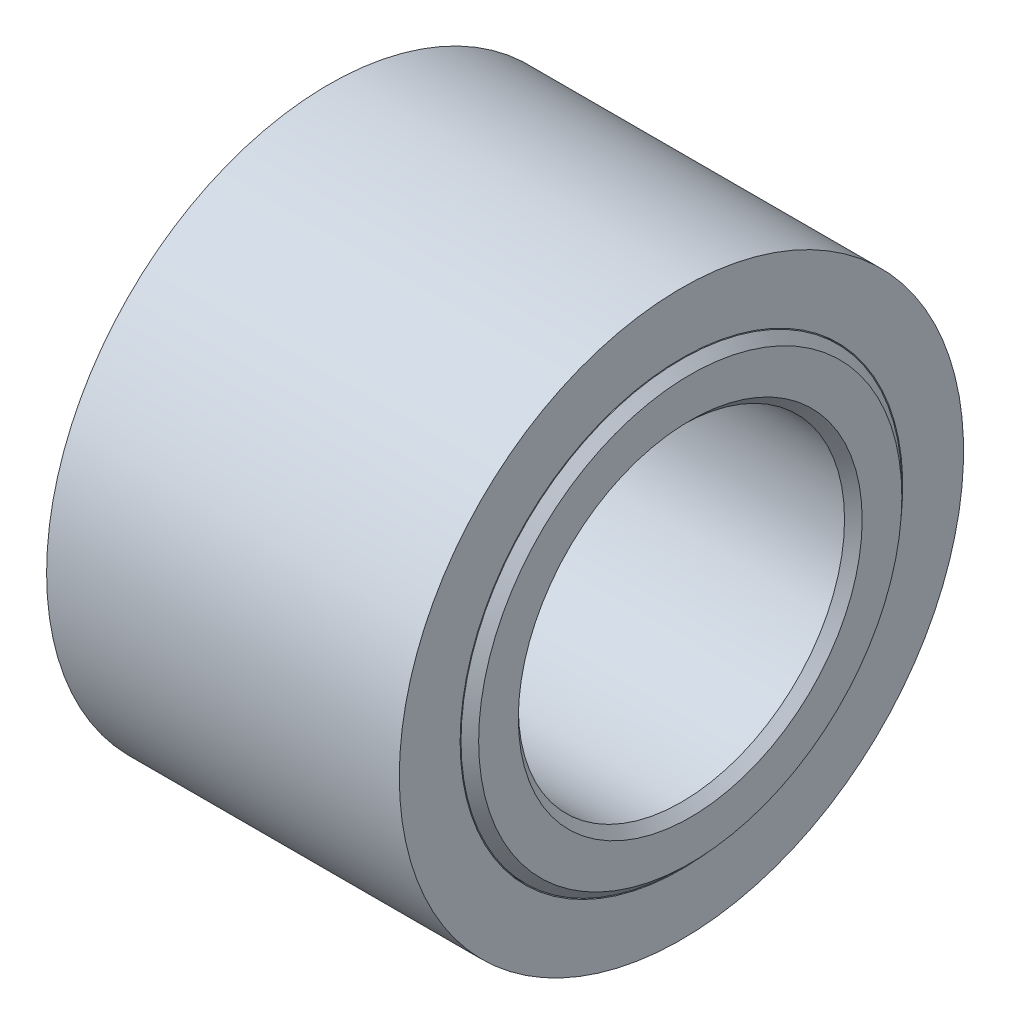
ISO-10303-21;
HEADER;
FILE_DESCRIPTION(('STEP AP214'),'2;1');
FILE_NAME('part.step','',(''),(''),'','','');
FILE_SCHEMA(('AUTOMOTIVE_DESIGN { 1 0 10303 214 1 1 1 1 }'));
ENDSEC;
DATA;
#1=APPLICATION_CONTEXT('core data for automotive mechanical design processes');
#2=APPLICATION_PROTOCOL_DEFINITION('international standard','automotive_design',2000,#1);
#3=PRODUCT_CONTEXT('',#1,'mechanical');
#4=PRODUCT('Part','Part','',(#3));
#5=PRODUCT_RELATED_PRODUCT_CATEGORY('part','',(#4));
#6=PRODUCT_DEFINITION_FORMATION('','',#4);
#7=PRODUCT_DEFINITION_CONTEXT('part definition',#1,'design');
#8=PRODUCT_DEFINITION('design','',#6,#7);
#9=PRODUCT_DEFINITION_SHAPE('','',#8);
#10=(LENGTH_UNIT() NAMED_UNIT(*) SI_UNIT(.MILLI.,.METRE.));
#11=(NAMED_UNIT(*) PLANE_ANGLE_UNIT() SI_UNIT($,.RADIAN.));
#12=(NAMED_UNIT(*) SI_UNIT($,.STERADIAN.) SOLID_ANGLE_UNIT());
#13=UNCERTAINTY_MEASURE_WITH_UNIT(LENGTH_MEASURE(1.E-05),#10,'distance_accuracy_value','');
#14=(GEOMETRIC_REPRESENTATION_CONTEXT(3) GLOBAL_UNCERTAINTY_ASSIGNED_CONTEXT((#13)) GLOBAL_UNIT_ASSIGNED_CONTEXT((#10,
#11,#12)) REPRESENTATION_CONTEXT('',''));
#15=CARTESIAN_POINT('',(0.,0.,0.));
#16=DIRECTION('',(0.,0.,1.));
#17=DIRECTION('',(1.,0.,0.));
#18=AXIS2_PLACEMENT_3D('',#15,#16,#17);
#19=CARTESIAN_POINT('',(0.,0.,0.));
#20=DIRECTION('',(-1.,0.,0.));
#21=DIRECTION('',(0.,0.,1.));
#22=AXIS2_PLACEMENT_3D('',#19,#20,#21);
#23=CYLINDRICAL_SURFACE('',#22,11.1);
#24=CARTESIAN_POINT('',(19.45,0.,0.));
#25=DIRECTION('',(-1.,0.,0.));
#26=DIRECTION('',(0.,0.,1.));
#27=AXIS2_PLACEMENT_3D('',#24,#25,#26);
#28=CIRCLE('',#27,11.1);
#29=CARTESIAN_POINT('',(19.45,0.,11.1));
#30=VERTEX_POINT('',#29);
#31=EDGE_CURVE('E72',#30,#30,#28,.T.);
#32=ORIENTED_EDGE('',*,*,#31,.F.);
#33=EDGE_LOOP('',(#32));
#34=FACE_BOUND('',#33,.T.);
#35=CARTESIAN_POINT('',(1.55,0.,0.));
#36=DIRECTION('',(-1.,0.,0.));
#37=DIRECTION('',(0.,0.,1.));
#38=AXIS2_PLACEMENT_3D('',#35,#36,#37);
#39=CIRCLE('',#38,11.1);
#40=CARTESIAN_POINT('',(1.55,0.,11.1));
#41=VERTEX_POINT('',#40);
#42=EDGE_CURVE('E11',#41,#41,#39,.T.);
#43=ORIENTED_EDGE('',*,*,#42,.T.);
#44=EDGE_LOOP('',(#43));
#45=FACE_BOUND('',#44,.T.);
#46=ADVANCED_FACE('F44',(#34,#45),#23,.F.);
#47=CARTESIAN_POINT('',(1.55,11.1,0.));
#48=DIRECTION('',(1.,0.,0.));
#49=DIRECTION('',(0.,0.,-1.));
#50=AXIS2_PLACEMENT_3D('',#47,#48,#49);
#51=PLANE('',#50);
#52=ORIENTED_EDGE('',*,*,#42,.F.);
#53=EDGE_LOOP('',(#52));
#54=FACE_BOUND('',#53,.T.);
#55=CARTESIAN_POINT('',(1.55,0.,0.));
#56=DIRECTION('',(-1.,0.,0.));
#57=DIRECTION('',(0.,0.,1.));
#58=AXIS2_PLACEMENT_3D('',#55,#56,#57);
#59=CIRCLE('',#58,12.55);
#60=CARTESIAN_POINT('',(1.55,0.,12.55));
#61=VERTEX_POINT('',#60);
#62=EDGE_CURVE('E50',#61,#61,#59,.T.);
#63=ORIENTED_EDGE('',*,*,#62,.T.);
#64=EDGE_LOOP('',(#63));
#65=FACE_BOUND('',#64,.T.);
#66=ADVANCED_FACE('F79',(#54,#65),#51,.F.);
#67=CARTESIAN_POINT('',(0.,0.,0.));
#68=DIRECTION('',(-1.,0.,0.));
#69=DIRECTION('',(0.,0.,1.));
#70=AXIS2_PLACEMENT_3D('',#67,#68,#69);
#71=CYLINDRICAL_SURFACE('',#70,12.55);
#72=ORIENTED_EDGE('',*,*,#62,.F.);
#73=EDGE_LOOP('',(#72));
#74=FACE_BOUND('',#73,.T.);
#75=CARTESIAN_POINT('',(0.5,0.,0.));
#76=DIRECTION('',(-1.,0.,0.));
#77=DIRECTION('',(0.,0.,1.));
#78=AXIS2_PLACEMENT_3D('',#75,#76,#77);
#79=CIRCLE('',#78,12.55);
#80=CARTESIAN_POINT('',(0.5,0.,12.55));
#81=VERTEX_POINT('',#80);
#82=EDGE_CURVE('E54',#81,#81,#79,.T.);
#83=ORIENTED_EDGE('',*,*,#82,.T.);
#84=EDGE_LOOP('',(#83));
#85=FACE_BOUND('',#84,.T.);
#86=ADVANCED_FACE('F83',(#74,#85),#71,.F.);
#87=CARTESIAN_POINT('',(0.5,12.55,0.));
#88=DIRECTION('',(1.,0.,0.));
#89=DIRECTION('',(0.,0.,-1.));
#90=AXIS2_PLACEMENT_3D('',#87,#88,#89);
#91=PLANE('',#90);
#92=ORIENTED_EDGE('',*,*,#82,.F.);
#93=EDGE_LOOP('',(#92));
#94=FACE_BOUND('',#93,.T.);
#95=CARTESIAN_POINT('',(0.5,0.,0.));
#96=DIRECTION('',(-1.,0.,0.));
#97=DIRECTION('',(0.,0.,1.));
#98=AXIS2_PLACEMENT_3D('',#95,#96,#97);
#99=CIRCLE('',#98,16.);
#100=CARTESIAN_POINT('',(0.5,0.,16.));
#101=VERTEX_POINT('',#100);
#102=EDGE_CURVE('E58',#101,#101,#99,.T.);
#103=ORIENTED_EDGE('',*,*,#102,.T.);
#104=EDGE_LOOP('',(#103));
#105=FACE_BOUND('',#104,.T.);
#106=ADVANCED_FACE('F88',(#94,#105),#91,.F.);
#107=CARTESIAN_POINT('',(0.,0.,0.));
#108=DIRECTION('',(-1.,0.,0.));
#109=DIRECTION('',(0.,0.,1.));
#110=AXIS2_PLACEMENT_3D('',#107,#108,#109);
#111=CYLINDRICAL_SURFACE('',#110,16.);
#112=ORIENTED_EDGE('',*,*,#102,.F.);
#113=EDGE_LOOP('',(#112));
#114=FACE_BOUND('',#113,.T.);
#115=CARTESIAN_POINT('',(20.5,0.,0.));
#116=DIRECTION('',(-1.,0.,0.));
#117=DIRECTION('',(0.,0.,1.));
#118=AXIS2_PLACEMENT_3D('',#115,#116,#117);
#119=CIRCLE('',#118,16.);
#120=CARTESIAN_POINT('',(20.5,0.,16.));
#121=VERTEX_POINT('',#120);
#122=EDGE_CURVE('E63',#121,#121,#119,.T.);
#123=ORIENTED_EDGE('',*,*,#122,.T.);
#124=EDGE_LOOP('',(#123));
#125=FACE_BOUND('',#124,.T.);
#126=ADVANCED_FACE('F94',(#114,#125),#111,.T.);
#127=CARTESIAN_POINT('',(20.5,16.,0.));
#128=DIRECTION('',(-1.,0.,0.));
#129=DIRECTION('',(0.,0.,1.));
#130=AXIS2_PLACEMENT_3D('',#127,#128,#129);
#131=PLANE('',#130);
#132=ORIENTED_EDGE('',*,*,#122,.F.);
#133=EDGE_LOOP('',(#132));
#134=FACE_BOUND('',#133,.T.);
#135=CARTESIAN_POINT('',(20.5,0.,0.));
#136=DIRECTION('',(-1.,0.,0.));
#137=DIRECTION('',(0.,0.,1.));
#138=AXIS2_PLACEMENT_3D('',#135,#136,#137);
#139=CIRCLE('',#138,12.55);
#140=CARTESIAN_POINT('',(20.5,0.,12.55));
#141=VERTEX_POINT('',#140);
#142=EDGE_CURVE('E66',#141,#141,#139,.T.);
#143=ORIENTED_EDGE('',*,*,#142,.T.);
#144=EDGE_LOOP('',(#143));
#145=FACE_BOUND('',#144,.T.);
#146=ADVANCED_FACE('F98',(#134,#145),#131,.F.);
#147=CARTESIAN_POINT('',(0.,0.,0.));
#148=DIRECTION('',(-1.,0.,0.));
#149=DIRECTION('',(0.,0.,1.));
#150=AXIS2_PLACEMENT_3D('',#147,#148,#149);
#151=CYLINDRICAL_SURFACE('',#150,12.55);
#152=ORIENTED_EDGE('',*,*,#142,.F.);
#153=EDGE_LOOP('',(#152));
#154=FACE_BOUND('',#153,.T.);
#155=CARTESIAN_POINT('',(19.45,0.,0.));
#156=DIRECTION('',(-1.,0.,0.));
#157=DIRECTION('',(0.,0.,1.));
#158=AXIS2_PLACEMENT_3D('',#155,#156,#157);
#159=CIRCLE('',#158,12.55);
#160=CARTESIAN_POINT('',(19.45,0.,12.55));
#161=VERTEX_POINT('',#160);
#162=EDGE_CURVE('E69',#161,#161,#159,.T.);
#163=ORIENTED_EDGE('',*,*,#162,.T.);
#164=EDGE_LOOP('',(#163));
#165=FACE_BOUND('',#164,.T.);
#166=ADVANCED_FACE('F102',(#154,#165),#151,.F.);
#167=CARTESIAN_POINT('',(19.45,12.55,0.));
#168=DIRECTION('',(-1.,0.,0.));
#169=DIRECTION('',(0.,0.,1.));
#170=AXIS2_PLACEMENT_3D('',#167,#168,#169);
#171=PLANE('',#170);
#172=ORIENTED_EDGE('',*,*,#162,.F.);
#173=EDGE_LOOP('',(#172));
#174=FACE_BOUND('',#173,.T.);
#175=ORIENTED_EDGE('',*,*,#31,.T.);
#176=EDGE_LOOP('',(#175));
#177=FACE_BOUND('',#176,.T.);
#178=ADVANCED_FACE('F76',(#174,#177),#171,.F.);
#179=CLOSED_SHELL('',(#46,#66,#86,#106,#126,#146,#166,#178));
#180=MANIFOLD_SOLID_BREP('B2',#179);
#181=CARTESIAN_POINT('',(0.,0.,0.));
#182=DIRECTION('',(1.,0.,0.));
#183=DIRECTION('',(0.,0.,-1.));
#184=AXIS2_PLACEMENT_3D('',#181,#182,#183);
#185=PLANE('',#184);
#186=CARTESIAN_POINT('',(0.,0.,0.));
#187=DIRECTION('',(1.,0.,0.));
#188=DIRECTION('',(0.,0.,-1.));
#189=AXIS2_PLACEMENT_3D('',#186,#187,#188);
#190=CIRCLE('',#189,12.);
#191=CARTESIAN_POINT('',(0.,0.,-12.));
#192=VERTEX_POINT('',#191);
#193=EDGE_CURVE('E173',#192,#192,#190,.F.);
#194=ORIENTED_EDGE('',*,*,#193,.T.);
#195=EDGE_LOOP('',(#194));
#196=FACE_BOUND('',#195,.T.);
#197=CARTESIAN_POINT('',(0.,0.,0.));
#198=DIRECTION('',(-1.,0.,0.));
#199=DIRECTION('',(0.,0.,1.));
#200=AXIS2_PLACEMENT_3D('',#197,#198,#199);
#201=CIRCLE('',#200,1.5);
#202=CARTESIAN_POINT('',(0.,0.,1.5));
#203=VERTEX_POINT('',#202);
#204=EDGE_CURVE('E251',#203,#203,#201,.T.);
#205=ORIENTED_EDGE('',*,*,#204,.F.);
#206=EDGE_LOOP('',(#205));
#207=FACE_BOUND('',#206,.T.);
#208=ADVANCED_FACE('F165',(#196,#207),#185,.F.);
#209=CARTESIAN_POINT('',(0.,0.,0.));
#210=DIRECTION('',(-1.,0.,0.));
#211=DIRECTION('',(0.,0.,1.));
#212=AXIS2_PLACEMENT_3D('',#209,#210,#211);
#213=CYLINDRICAL_SURFACE('',#212,12.5);
#214=CARTESIAN_POINT('',(0.500000000000009,0.,0.));
#215=DIRECTION('',(1.,0.,0.));
#216=DIRECTION('',(0.,0.,-1.));
#217=AXIS2_PLACEMENT_3D('',#214,#215,#216);
#218=CIRCLE('',#217,12.5);
#219=CARTESIAN_POINT('',(0.500000000000009,0.,-12.5));
#220=VERTEX_POINT('',#219);
#221=EDGE_CURVE('E42',#220,#220,#218,.T.);
#222=ORIENTED_EDGE('',*,*,#221,.T.);
#223=EDGE_LOOP('',(#222));
#224=FACE_BOUND('',#223,.T.);
#225=CARTESIAN_POINT('',(1.5,0.,0.));
#226=DIRECTION('',(-1.,0.,0.));
#227=DIRECTION('',(0.,0.,1.));
#228=AXIS2_PLACEMENT_3D('',#225,#226,#227);
#229=CIRCLE('',#228,12.5);
#230=CARTESIAN_POINT('',(1.5,0.,12.5));
#231=VERTEX_POINT('',#230);
#232=EDGE_CURVE('E233',#231,#231,#229,.T.);
#233=ORIENTED_EDGE('',*,*,#232,.T.);
#234=EDGE_LOOP('',(#233));
#235=FACE_BOUND('',#234,.T.);
#236=ADVANCED_FACE('F276',(#224,#235),#213,.T.);
#237=CARTESIAN_POINT('',(1.5,12.5,0.));
#238=DIRECTION('',(-1.,0.,0.));
#239=DIRECTION('',(0.,0.,1.));
#240=AXIS2_PLACEMENT_3D('',#237,#238,#239);
#241=PLANE('',#240);
#242=ORIENTED_EDGE('',*,*,#232,.F.);
#243=EDGE_LOOP('',(#242));
#244=FACE_BOUND('',#243,.T.);
#245=CARTESIAN_POINT('',(1.5,0.,0.));
#246=DIRECTION('',(-1.,0.,0.));
#247=DIRECTION('',(0.,0.,1.));
#248=AXIS2_PLACEMENT_3D('',#245,#246,#247);
#249=CIRCLE('',#248,11.);
#250=CARTESIAN_POINT('',(1.5,0.,11.));
#251=VERTEX_POINT('',#250);
#252=EDGE_CURVE('E236',#251,#251,#249,.T.);
#253=ORIENTED_EDGE('',*,*,#252,.T.);
#254=EDGE_LOOP('',(#253));
#255=FACE_BOUND('',#254,.T.);
#256=ADVANCED_FACE('F281',(#244,#255),#241,.F.);
#257=CARTESIAN_POINT('',(0.,0.,0.));
#258=DIRECTION('',(-1.,0.,0.));
#259=DIRECTION('',(0.,0.,1.));
#260=AXIS2_PLACEMENT_3D('',#257,#258,#259);
#261=CYLINDRICAL_SURFACE('',#260,11.);
#262=CARTESIAN_POINT('',(4.,10.8755459633069,1.64999999999999));
#263=CARTESIAN_POINT('',(3.90787987378105,10.8755475033545,1.64999619518012));
#264=CARTESIAN_POINT('',(3.81570627417422,10.8767290691301,1.64225926027339));
#265=CARTESIAN_POINT('',(3.63393615362856,10.8813244628356,1.611524163227));
#266=CARTESIAN_POINT('',(3.54434223537199,10.8847404680457,1.5885111154289));
#267=CARTESIAN_POINT('',(3.37038886900841,10.8934093288485,1.52792778707892));
#268=CARTESIAN_POINT('',(3.28602546120363,10.8986607744469,1.49036867849536));
#269=CARTESIAN_POINT('',(3.12481026615071,10.9104071352446,1.4017856939657));
#270=CARTESIAN_POINT('',(3.04795744676428,10.9169018792204,1.35076367172858));
#271=CARTESIAN_POINT('',(2.90331780157024,10.9304611817284,1.23626692660414));
#272=CARTESIAN_POINT('',(2.83559982525259,10.9375294870386,1.17270566143302));
#273=CARTESIAN_POINT('',(2.71174876577896,10.9514060498595,1.03512156598881));
#274=CARTESIAN_POINT('',(2.65561631961632,10.9582142930548,0.961098160865179));
#275=CARTESIAN_POINT('',(2.55627570513951,10.97084282171,0.804249993858016));
#276=CARTESIAN_POINT('',(2.5131309346453,10.9766582027913,0.721384650102341));
#277=CARTESIAN_POINT('',(2.44139724131101,10.9866042742105,0.54948173511767));
#278=CARTESIAN_POINT('',(2.41280754937283,10.9907350535614,0.460444490297743));
#279=CARTESIAN_POINT('',(2.37120427261608,10.9968200627756,0.279434235399626));
#280=CARTESIAN_POINT('',(2.35807540097413,10.9987903947608,0.187488272828852));
#281=CARTESIAN_POINT('',(2.34740847169262,11.0003876924654,0.00267872442142723));
#282=CARTESIAN_POINT('',(2.34986954734835,11.0000147884543,-0.0901848101173202));
#283=CARTESIAN_POINT('',(2.37022167153868,10.9969804962687,-0.27340689002057));
#284=CARTESIAN_POINT('',(2.38798868897064,10.9943375041773,-0.363779560540007));
#285=CARTESIAN_POINT('',(2.43825366695484,10.9870805025064,-0.540246112057449));
#286=CARTESIAN_POINT('',(2.47075200665159,10.9824664421971,-0.626339882864827));
#287=CARTESIAN_POINT('',(2.54968409660881,10.9717541326053,-0.792180158847345));
#288=CARTESIAN_POINT('',(2.59617006161962,10.965650338672,-0.871901439555952));
#289=CARTESIAN_POINT('',(2.70171971303699,10.9526388206996,-1.02245869786519));
#290=CARTESIAN_POINT('',(2.76078422737756,10.945731043755,-1.0932940900989));
#291=CARTESIAN_POINT('',(2.89050529370925,10.9318017401189,-1.2247999309949));
#292=CARTESIAN_POINT('',(2.96127013416713,10.9247797628558,-1.28536356246041));
#293=CARTESIAN_POINT('',(3.11201518483611,10.9114797489888,-1.39377259272693));
#294=CARTESIAN_POINT('',(3.19199545179192,10.9052017169661,-1.44161791320798));
#295=CARTESIAN_POINT('',(3.35901235923471,10.8941005281554,-1.52324660988065));
#296=CARTESIAN_POINT('',(3.44605444702863,10.8892785082982,-1.55701900497089));
#297=CARTESIAN_POINT('',(3.62466378066213,10.8816554318897,-1.60943569829766));
#298=CARTESIAN_POINT('',(3.71623070710143,10.8788542329093,-1.62808106271058));
#299=CARTESIAN_POINT('',(3.90034009853524,10.8756169653453,-1.6495679209532));
#300=CARTESIAN_POINT('',(3.99286450702169,10.8751582368283,-1.65256083591557));
#301=CARTESIAN_POINT('',(4.17709361429907,10.8765976873087,-1.643059627218));
#302=CARTESIAN_POINT('',(4.26879833843584,10.8784957931736,-1.63056598410532));
#303=CARTESIAN_POINT('',(4.44831579976219,10.884414227076,-1.59057473248042));
#304=CARTESIAN_POINT('',(4.53614572543576,10.8884238813114,-1.56315256380602));
#305=CARTESIAN_POINT('',(4.70596250125346,10.8981048200834,-1.49416115141795));
#306=CARTESIAN_POINT('',(4.78794906259101,10.9037761866789,-1.45259120904027));
#307=CARTESIAN_POINT('',(4.94443058636854,10.9161949125577,-1.35612045794855));
#308=CARTESIAN_POINT('',(5.01886449200779,10.9229500520799,-1.30112163017942));
#309=CARTESIAN_POINT('',(5.15750014586119,10.9367517537669,-1.17949058520921));
#310=CARTESIAN_POINT('',(5.22170131509926,10.9437983323932,-1.11285771019147));
#311=CARTESIAN_POINT('',(5.33859286729694,10.9574597573913,-0.969183181590997));
#312=CARTESIAN_POINT('',(5.39118290106672,10.9640705180647,-0.892059439449148));
#313=CARTESIAN_POINT('',(5.4826601957889,10.9760519553522,-0.729984288290045));
#314=CARTESIAN_POINT('',(5.52154783161153,10.9814226658902,-0.64503309349648));
#315=CARTESIAN_POINT('',(5.58435611673683,10.9903009662687,-0.47002779544726));
#316=CARTESIAN_POINT('',(5.60833163378619,10.9938153788969,-0.379993744629731));
#317=CARTESIAN_POINT('',(5.64081266749121,10.9986137432259,-0.197120897051312));
#318=CARTESIAN_POINT('',(5.64931920587405,10.9998978422388,-0.104282285943639));
#319=CARTESIAN_POINT('',(5.65059587500434,11.0000894196506,0.0805910499468998));
#320=CARTESIAN_POINT('',(5.64351954896467,10.9990200872618,0.172624727233256));
#321=CARTESIAN_POINT('',(5.61416047273716,10.9946717157106,0.354177774855416));
#322=CARTESIAN_POINT('',(5.59187777121058,10.9913926836193,0.443697153236162));
#323=CARTESIAN_POINT('',(5.53279293687273,10.9829916541671,0.617638311817625));
#324=CARTESIAN_POINT('',(5.49600143534717,10.9778710064864,0.702063772463659));
#325=CARTESIAN_POINT('',(5.40895976321853,10.9663491794505,0.86356722968626));
#326=CARTESIAN_POINT('',(5.35870915567162,10.9599479585237,0.940644987612776));
#327=CARTESIAN_POINT('',(5.2456205312879,10.946501616998,1.08604384371115));
#328=CARTESIAN_POINT('',(5.18266915160202,10.9394510326854,1.15427627309102));
#329=CARTESIAN_POINT('',(5.04620441961147,10.925541018579,1.27926489229294));
#330=CARTESIAN_POINT('',(4.97268859179321,10.9186816340392,1.33601838478882));
#331=CARTESIAN_POINT('',(4.81669611844421,10.9058893243203,1.43672441905271));
#332=CARTESIAN_POINT('',(4.73417144127598,10.8999618217268,1.48060323720329));
#333=CARTESIAN_POINT('',(4.56287354556037,10.889768000218,1.55381175259249));
#334=CARTESIAN_POINT('',(4.47410692135639,10.8854999583872,1.58315654832387));
#335=CARTESIAN_POINT('',(4.32078482011787,10.8800943407731,1.61980447079028));
#336=CARTESIAN_POINT('',(4.2571762633833,10.8783977432062,1.63111046758461));
#337=CARTESIAN_POINT('',(4.12905387909222,10.8761230222371,1.64620951634231));
#338=CARTESIAN_POINT('',(4.06454006328043,10.8755448843377,1.65000266568583));
#339=CARTESIAN_POINT('',(4.,10.8755459633069,1.64999999999999));
#340=B_SPLINE_CURVE_WITH_KNOTS('',3,(#262,#263,#264,#265,#266,#267,#268,#269,#270,#271,#272,
#273,#274,#275,#276,#277,#278,#279,#280,#281,#282,#283,#284,#285,#286,#287,#288,#289,#290,#291,
#292,#293,#294,#295,#296,#297,#298,#299,#300,#301,#302,#303,#304,#305,#306,#307,#308,#309,#310,
#311,#312,#313,#314,#315,#316,#317,#318,#319,#320,#321,#322,#323,#324,#325,#326,#327,#328,#329,
#330,#331,#332,#333,#334,#335,#336,#337,#338,#339),.UNSPECIFIED.,.T.,.F.,(4,2,2,2,2,2,2,2,2,2,2,
2,2,2,2,2,2,2,2,2,2,2,2,2,2,2,2,2,2,2,2,2,2,2,2,2,2,2,4),(0.,0.276124476985353,
0.552518416517979,0.828700493869238,1.10484456352745,1.38296574514017,1.66110221428598,
1.94057514316359,2.22003330300949,2.49739415787835,2.7747395933331,3.04985848767299,
3.3249844632334,3.60115048025097,3.87733468044197,4.15623499132894,4.43513701965783,
4.7142562695045,4.99335584488773,5.26975036064116,5.54613630009907,5.82113834288109,
6.09615396814726,6.37324034601429,6.65034239607979,6.92975291528864,7.20915578979036,
7.48752444980195,7.76587472287517,8.04149459984555,8.31711359482101,8.59253100483612,
8.86795735723813,9.14596045012062,9.42402879260544,9.7036596670742,9.98299943790115,
10.1764568608077,10.3699117761381),.UNSPECIFIED.);
#341=CARTESIAN_POINT('',(4.,10.8755459633069,1.64999999999999));
#342=VERTEX_POINT('',#341);
#343=EDGE_CURVE('E254',#342,#342,#340,.T.);
#344=ORIENTED_EDGE('',*,*,#343,.T.);
#345=EDGE_LOOP('',(#344));
#346=FACE_BOUND('',#345,.T.);
#347=ORIENTED_EDGE('',*,*,#252,.F.);
#348=EDGE_LOOP('',(#347));
#349=FACE_BOUND('',#348,.T.);
#350=CARTESIAN_POINT('',(19.5,0.,0.));
#351=DIRECTION('',(-1.,0.,0.));
#352=DIRECTION('',(0.,0.,1.));
#353=AXIS2_PLACEMENT_3D('',#350,#351,#352);
#354=CIRCLE('',#353,11.);
#355=CARTESIAN_POINT('',(19.5,0.,11.));
#356=VERTEX_POINT('',#355);
#357=EDGE_CURVE('E239',#356,#356,#354,.T.);
#358=ORIENTED_EDGE('',*,*,#357,.T.);
#359=EDGE_LOOP('',(#358));
#360=FACE_BOUND('',#359,.T.);
#361=ADVANCED_FACE('F259',(#346,#349,#360),#261,.T.);
#362=CARTESIAN_POINT('',(19.5,11.,0.));
#363=DIRECTION('',(1.,0.,0.));
#364=DIRECTION('',(0.,0.,-1.));
#365=AXIS2_PLACEMENT_3D('',#362,#363,#364);
#366=PLANE('',#365);
#367=ORIENTED_EDGE('',*,*,#357,.F.);
#368=EDGE_LOOP('',(#367));
#369=FACE_BOUND('',#368,.T.);
#370=CARTESIAN_POINT('',(19.5,0.,0.));
#371=DIRECTION('',(-1.,0.,0.));
#372=DIRECTION('',(0.,0.,1.));
#373=AXIS2_PLACEMENT_3D('',#370,#371,#372);
#374=CIRCLE('',#373,12.5);
#375=CARTESIAN_POINT('',(19.5,0.,12.5));
#376=VERTEX_POINT('',#375);
#377=EDGE_CURVE('E242',#376,#376,#374,.T.);
#378=ORIENTED_EDGE('',*,*,#377,.T.);
#379=EDGE_LOOP('',(#378));
#380=FACE_BOUND('',#379,.T.);
#381=ADVANCED_FACE('F310',(#369,#380),#366,.F.);
#382=CARTESIAN_POINT('',(0.,0.,0.));
#383=DIRECTION('',(-1.,0.,0.));
#384=DIRECTION('',(0.,0.,1.));
#385=AXIS2_PLACEMENT_3D('',#382,#383,#384);
#386=CYLINDRICAL_SURFACE('',#385,12.5);
#387=CARTESIAN_POINT('',(20.5,0.,0.));
#388=DIRECTION('',(-1.,0.,0.));
#389=DIRECTION('',(0.,0.,1.));
#390=AXIS2_PLACEMENT_3D('',#387,#388,#389);
#391=CIRCLE('',#390,12.5);
#392=CARTESIAN_POINT('',(20.5,0.,12.5));
#393=VERTEX_POINT('',#392);
#394=EDGE_CURVE('E388',#393,#393,#391,.T.);
#395=ORIENTED_EDGE('',*,*,#394,.T.);
#396=EDGE_LOOP('',(#395));
#397=FACE_BOUND('',#396,.T.);
#398=ORIENTED_EDGE('',*,*,#377,.F.);
#399=EDGE_LOOP('',(#398));
#400=FACE_BOUND('',#399,.T.);
#401=ADVANCED_FACE('F304',(#397,#400),#386,.T.);
#402=CARTESIAN_POINT('',(21.,12.5,0.));
#403=DIRECTION('',(-1.,0.,0.));
#404=DIRECTION('',(0.,0.,1.));
#405=AXIS2_PLACEMENT_3D('',#402,#403,#404);
#406=PLANE('',#405);
#407=CARTESIAN_POINT('',(21.,0.,0.));
#408=DIRECTION('',(-1.,0.,0.));
#409=DIRECTION('',(0.,0.,1.));
#410=AXIS2_PLACEMENT_3D('',#407,#408,#409);
#411=CIRCLE('',#410,9.75);
#412=CARTESIAN_POINT('',(21.,0.,9.75));
#413=VERTEX_POINT('',#412);
#414=EDGE_CURVE('E210',#413,#413,#411,.T.);
#415=ORIENTED_EDGE('',*,*,#414,.T.);
#416=EDGE_LOOP('',(#415));
#417=FACE_BOUND('',#416,.T.);
#418=CARTESIAN_POINT('',(21.,0.,0.));
#419=DIRECTION('',(-1.,0.,0.));
#420=DIRECTION('',(0.,0.,1.));
#421=AXIS2_PLACEMENT_3D('',#418,#419,#420);
#422=CIRCLE('',#421,12.);
#423=CARTESIAN_POINT('',(21.,0.,12.));
#424=VERTEX_POINT('',#423);
#425=EDGE_CURVE('E207',#424,#424,#422,.F.);
#426=ORIENTED_EDGE('',*,*,#425,.T.);
#427=EDGE_LOOP('',(#426));
#428=FACE_BOUND('',#427,.T.);
#429=ADVANCED_FACE('F298',(#417,#428),#406,.F.);
#430=CARTESIAN_POINT('',(0.,0.,0.));
#431=DIRECTION('',(-1.,0.,0.));
#432=DIRECTION('',(0.,0.,1.));
#433=AXIS2_PLACEMENT_3D('',#430,#431,#432);
#434=CYLINDRICAL_SURFACE('',#433,9.25);
#435=CARTESIAN_POINT('',(20.5,0.,0.));
#436=DIRECTION('',(-1.,0.,0.));
#437=DIRECTION('',(0.,0.,1.));
#438=AXIS2_PLACEMENT_3D('',#435,#436,#437);
#439=CIRCLE('',#438,9.25);
#440=CARTESIAN_POINT('',(20.5,0.,9.25));
#441=VERTEX_POINT('',#440);
#442=EDGE_CURVE('E390',#441,#441,#439,.F.);
#443=ORIENTED_EDGE('',*,*,#442,.T.);
#444=EDGE_LOOP('',(#443));
#445=FACE_BOUND('',#444,.T.);
#446=CARTESIAN_POINT('',(7.00000000000001,0.,0.));
#447=DIRECTION('',(-1.,0.,0.));
#448=DIRECTION('',(0.,0.,1.));
#449=AXIS2_PLACEMENT_3D('',#446,#447,#448);
#450=CIRCLE('',#449,9.25);
#451=CARTESIAN_POINT('',(7.00000000000001,0.,9.25));
#452=VERTEX_POINT('',#451);
#453=EDGE_CURVE('E245',#452,#452,#450,.T.);
#454=ORIENTED_EDGE('',*,*,#453,.T.);
#455=EDGE_LOOP('',(#454));
#456=FACE_BOUND('',#455,.T.);
#457=ADVANCED_FACE('F294',(#445,#456),#434,.F.);
#458=CARTESIAN_POINT('',(7.00000000000001,9.25,0.));
#459=DIRECTION('',(-1.,0.,0.));
#460=DIRECTION('',(0.,0.,1.));
#461=AXIS2_PLACEMENT_3D('',#458,#459,#460);
#462=PLANE('',#461);
#463=CARTESIAN_POINT('',(7.00000000000001,0.,0.));
#464=DIRECTION('',(-1.,0.,0.));
#465=DIRECTION('',(0.,0.,1.));
#466=AXIS2_PLACEMENT_3D('',#463,#464,#465);
#467=CIRCLE('',#466,1.5);
#468=CARTESIAN_POINT('',(7.00000000000001,0.,1.5));
#469=VERTEX_POINT('',#468);
#470=EDGE_CURVE('E248',#469,#469,#467,.F.);
#471=ORIENTED_EDGE('',*,*,#470,.F.);
#472=EDGE_LOOP('',(#471));
#473=FACE_BOUND('',#472,.T.);
#474=ORIENTED_EDGE('',*,*,#453,.F.);
#475=EDGE_LOOP('',(#474));
#476=FACE_BOUND('',#475,.T.);
#477=ADVANCED_FACE('F289',(#473,#476),#462,.F.);
#478=CARTESIAN_POINT('',(21.001,0.,0.));
#479=DIRECTION('',(-1.,0.,0.));
#480=DIRECTION('',(0.,0.,1.));
#481=AXIS2_PLACEMENT_3D('',#478,#479,#480);
#482=CYLINDRICAL_SURFACE('',#481,1.5);
#483=DIRECTION('',(-1.,0.,0.));
#484=VECTOR('',#483,1.);
#485=CARTESIAN_POINT('',(21.001,0.,-1.5));
#486=LINE('',#485,#484);
#487=CARTESIAN_POINT('',(4.68738635424336,0.,-1.5));
#488=VERTEX_POINT('',#487);
#489=CARTESIAN_POINT('',(3.31261364575664,0.,-1.5));
#490=VERTEX_POINT('',#489);
#491=EDGE_CURVE('E198',#488,#490,#486,.T.);
#492=ORIENTED_EDGE('',*,*,#491,.T.);
#493=CARTESIAN_POINT('',(3.31261364575664,0.,-1.5));
#494=CARTESIAN_POINT('',(3.31263332444945,0.0221484449998915,-1.50000447406715));
#495=CARTESIAN_POINT('',(3.31154216342062,0.044276134141359,-1.49950927634109));
#496=CARTESIAN_POINT('',(3.30731407690516,0.0882309407560374,-1.49756294449903));
#497=CARTESIAN_POINT('',(3.30418304299496,0.110058739556769,-1.49611456325326));
#498=CARTESIAN_POINT('',(3.29213894012383,0.174065145863211,-1.49047328028752));
#499=CARTESIAN_POINT('',(3.28056103106486,0.215631523118339,-1.48498052511108));
#500=CARTESIAN_POINT('',(3.2452453340166,0.316953438714507,-1.46744293306414));
#501=CARTESIAN_POINT('',(3.21831774587714,0.375195737109226,-1.45348605708138));
#502=CARTESIAN_POINT('',(3.15864988415343,0.487494349877065,-1.41979888355067));
#503=CARTESIAN_POINT('',(3.12584506054335,0.541493471462897,-1.40000270816456));
#504=CARTESIAN_POINT('',(3.0618822065467,0.639336298720912,-1.35783883670072));
#505=CARTESIAN_POINT('',(3.03099961496453,0.683620767198729,-1.33606556934905));
#506=CARTESIAN_POINT('',(2.96859754913488,0.769517732585914,-1.28850839632405));
#507=CARTESIAN_POINT('',(2.93707767082781,0.811128459664328,-1.26272187201679));
#508=CARTESIAN_POINT('',(2.84316424696105,0.93185550115015,-1.17948671828247));
#509=CARTESIAN_POINT('',(2.78113143282916,1.00727266753873,-1.11598629807276));
#510=CARTESIAN_POINT('',(2.67821680199984,1.12931924692285,-0.990098916855102));
#511=CARTESIAN_POINT('',(2.63589303481993,1.17846008304906,-0.931303964781118));
#512=CARTESIAN_POINT('',(2.55729432656194,1.26861923064038,-0.804150695646666));
#513=CARTESIAN_POINT('',(2.52101128898695,1.30964842834388,-0.735805408924682));
#514=CARTESIAN_POINT('',(2.46347445044817,1.37425523156209,-0.604688012192464));
#515=CARTESIAN_POINT('',(2.44066663412036,1.39968098658133,-0.543514926662854));
#516=CARTESIAN_POINT('',(2.40201404221609,1.44261831335075,-0.416346887973422));
#517=CARTESIAN_POINT('',(2.3861646608905,1.46013512020818,-0.350355158091534));
#518=CARTESIAN_POINT('',(2.36257670412615,1.4861647140112,-0.214726616012652));
#519=CARTESIAN_POINT('',(2.35488982563048,1.494620113907,-0.14506946923284));
#520=CARTESIAN_POINT('',(2.34851747145456,1.50163145239621,-0.00485236427368107));
#521=CARTESIAN_POINT('',(2.34982867653179,1.50019104138851,0.0657072514139793));
#522=CARTESIAN_POINT('',(2.36072191383893,1.48819943697544,0.19805585654478));
#523=CARTESIAN_POINT('',(2.36944850680373,1.47859051716961,0.260006547660196));
#524=CARTESIAN_POINT('',(2.39340859236544,1.45212512243361,0.381012828513424));
#525=CARTESIAN_POINT('',(2.4086433349569,1.43526725522268,0.440067859663008));
#526=CARTESIAN_POINT('',(2.44558272145756,1.39420159043157,0.556985503150736));
#527=CARTESIAN_POINT('',(2.46757157750178,1.36966981058903,0.614642568564464));
#528=CARTESIAN_POINT('',(2.51648080586364,1.31471839277816,0.724782673881044));
#529=CARTESIAN_POINT('',(2.54340318613219,1.28429635718163,0.777263593659041));
#530=CARTESIAN_POINT('',(2.6162317756353,1.20121185017075,0.902985502421483));
#531=CARTESIAN_POINT('',(2.66466961182816,1.1452732795972,0.972607311476638));
#532=CARTESIAN_POINT('',(2.76677976583923,1.02439312474697,1.09923918777515));
#533=CARTESIAN_POINT('',(2.82046906968799,0.959422018494181,1.1562062400392));
#534=CARTESIAN_POINT('',(2.93087630999231,0.820030708328009,1.25906875302783));
#535=CARTESIAN_POINT('',(2.98763609854248,0.74541985968591,1.30466286148348));
#536=CARTESIAN_POINT('',(3.07003302171162,0.626989417453356,1.36338214886628));
#537=CARTESIAN_POINT('',(3.09702901112283,0.586448311247497,1.38133684919242));
#538=CARTESIAN_POINT('',(3.14897250092499,0.502822395260102,1.41392509255887));
#539=CARTESIAN_POINT('',(3.17392252580561,0.459740836545142,1.42856276901354));
#540=CARTESIAN_POINT('',(3.21766438687963,0.37512927823825,1.45293241521923));
#541=CARTESIAN_POINT('',(3.23682569909762,0.333895642009352,1.46301415456402));
#542=CARTESIAN_POINT('',(3.26996190615681,0.248928057972141,1.47982745388688));
#543=CARTESIAN_POINT('',(3.28397025059878,0.205212441634934,1.48658072104477));
#544=CARTESIAN_POINT('',(3.30006996711576,0.134320181687053,1.49420358558965));
#545=CARTESIAN_POINT('',(3.30469497204195,0.107861991820305,1.49635252195317));
#546=CARTESIAN_POINT('',(3.31100289706569,0.0542883536749708,1.49926218434104));
#547=CARTESIAN_POINT('',(3.3126591744012,0.0271691459158376,1.50001034175023));
#548=CARTESIAN_POINT('',(3.31261364575664,0.,1.5));
#549=B_SPLINE_CURVE_WITH_KNOTS('',3,(#493,#494,#495,#496,#497,#498,#499,#500,#501,#502,#503,
#504,#505,#506,#507,#508,#509,#510,#511,#512,#513,#514,#515,#516,#517,#518,#519,#520,#521,#522,
#523,#524,#525,#526,#527,#528,#529,#530,#531,#532,#533,#534,#535,#536,#537,#538,#539,#540,#541,
#542,#543,#544,#545,#546,#547,#548),.UNSPECIFIED.,.F.,.F.,(4,2,2,2,2,2,2,2,2,2,2,2,2,2,2,2,2,2,
2,2,2,2,2,2,2,2,2,4),(0.,0.0663780026565318,0.132565136709905,0.26239156828519,
0.458312912660752,0.656535147557369,0.830949570164955,1.00547827832983,1.35297301132437,
1.61471771431488,1.87610872160455,2.08546425100029,2.29468099946102,2.50521505325032,
2.71567144872451,2.90470632319764,3.09377752118681,3.29225659457519,3.49081662935398,
3.7939273115488,4.09805305096362,4.40953989932393,4.56513131068288,4.7205277568222,
4.85993701945224,4.99842465742859,5.07906895311344,5.16043343232563),.UNSPECIFIED.);
#550=CARTESIAN_POINT('',(3.31261364575664,0.,1.5));
#551=VERTEX_POINT('',#550);
#552=EDGE_CURVE('E185',#490,#551,#549,.T.);
#553=ORIENTED_EDGE('',*,*,#552,.T.);
#554=DIRECTION('',(-1.,0.,0.));
#555=VECTOR('',#554,1.);
#556=CARTESIAN_POINT('',(21.001,0.,1.5));
#557=LINE('',#556,#555);
#558=CARTESIAN_POINT('',(4.68738635424336,0.,1.5));
#559=VERTEX_POINT('',#558);
#560=EDGE_CURVE('E193',#551,#559,#557,.F.);
#561=ORIENTED_EDGE('',*,*,#560,.T.);
#562=CARTESIAN_POINT('',(4.68738635424336,0.,1.5));
#563=CARTESIAN_POINT('',(4.68736667555055,0.0221484449998915,1.50000447406715));
#564=CARTESIAN_POINT('',(4.68845783657938,0.0442761341413591,1.49950927634109));
#565=CARTESIAN_POINT('',(4.69268592309484,0.0882309407560375,1.49756294449903));
#566=CARTESIAN_POINT('',(4.69581695700504,0.110058739556769,1.49611456325326));
#567=CARTESIAN_POINT('',(4.70786105987617,0.174065145863211,1.49047328028752));
#568=CARTESIAN_POINT('',(4.71943896893514,0.215631523118339,1.48498052511108));
#569=CARTESIAN_POINT('',(4.7547546659834,0.316953438714507,1.46744293306414));
#570=CARTESIAN_POINT('',(4.78168225412286,0.375195737109226,1.45348605708138));
#571=CARTESIAN_POINT('',(4.84135011584657,0.487494349877065,1.41979888355067));
#572=CARTESIAN_POINT('',(4.87415493945665,0.541493471462896,1.40000270816456));
#573=CARTESIAN_POINT('',(4.9381177934533,0.639336298720912,1.35783883670072));
#574=CARTESIAN_POINT('',(4.96900038503547,0.683620767198729,1.33606556934905));
#575=CARTESIAN_POINT('',(5.03140245086512,0.769517732585914,1.28850839632405));
#576=CARTESIAN_POINT('',(5.06292232917219,0.811128459664329,1.26272187201679));
#577=CARTESIAN_POINT('',(5.15683575303895,0.931855501150151,1.17948671828247));
#578=CARTESIAN_POINT('',(5.21886856717084,1.00727266753873,1.11598629807276));
#579=CARTESIAN_POINT('',(5.32178319800017,1.12931924692285,0.990098916855102));
#580=CARTESIAN_POINT('',(5.36410696518007,1.17846008304906,0.931303964781118));
#581=CARTESIAN_POINT('',(5.44270567343806,1.26861923064038,0.804150695646665));
#582=CARTESIAN_POINT('',(5.47898871101305,1.30964842834388,0.735805408924681));
#583=CARTESIAN_POINT('',(5.53652554955183,1.37425523156209,0.604688012192463));
#584=CARTESIAN_POINT('',(5.55933336587964,1.39968098658133,0.543514926662853));
#585=CARTESIAN_POINT('',(5.59798595778391,1.44261831335075,0.416346887973421));
#586=CARTESIAN_POINT('',(5.6138353391095,1.46013512020818,0.350355158091533));
#587=CARTESIAN_POINT('',(5.63742329587385,1.4861647140112,0.214726616012652));
#588=CARTESIAN_POINT('',(5.64511017436952,1.494620113907,0.145069469232839));
#589=CARTESIAN_POINT('',(5.65148252854544,1.5016314523962,0.00485236427368103));
#590=CARTESIAN_POINT('',(5.65017132346821,1.50019104138851,-0.0657072514139793));
#591=CARTESIAN_POINT('',(5.63927808616107,1.48819943697544,-0.19805585654478));
#592=CARTESIAN_POINT('',(5.63055149319627,1.47859051716962,-0.260006547660196));
#593=CARTESIAN_POINT('',(5.60659140763456,1.45212512243361,-0.381012828513424));
#594=CARTESIAN_POINT('',(5.5913566650431,1.43526725522268,-0.440067859663007));
#595=CARTESIAN_POINT('',(5.55441727854244,1.39420159043157,-0.556985503150736));
#596=CARTESIAN_POINT('',(5.53242842249822,1.36966981058903,-0.614642568564463));
#597=CARTESIAN_POINT('',(5.48351919413636,1.31471839277816,-0.724782673881043));
#598=CARTESIAN_POINT('',(5.45659681386781,1.28429635718163,-0.77726359365904));
#599=CARTESIAN_POINT('',(5.3837682243647,1.20121185017075,-0.902985502421482));
#600=CARTESIAN_POINT('',(5.33533038817184,1.1452732795972,-0.972607311476638));
#601=CARTESIAN_POINT('',(5.23322023416077,1.02439312474697,-1.09923918777515));
#602=CARTESIAN_POINT('',(5.17953093031201,0.959422018494181,-1.1562062400392));
#603=CARTESIAN_POINT('',(5.06912369000769,0.82003070832801,-1.25906875302783));
#604=CARTESIAN_POINT('',(5.01236390145752,0.74541985968591,-1.30466286148348));
#605=CARTESIAN_POINT('',(4.92996697828838,0.626989417453356,-1.36338214886628));
#606=CARTESIAN_POINT('',(4.90297098887717,0.586448311247497,-1.38133684919242));
#607=CARTESIAN_POINT('',(4.85102749907501,0.502822395260103,-1.41392509255887));
#608=CARTESIAN_POINT('',(4.82607747419439,0.459740836545143,-1.42856276901354));
#609=CARTESIAN_POINT('',(4.78233561312037,0.375129278238252,-1.45293241521923));
#610=CARTESIAN_POINT('',(4.76317430090238,0.333895642009354,-1.46301415456402));
#611=CARTESIAN_POINT('',(4.73003809384319,0.248928057972143,-1.47982745388688));
#612=CARTESIAN_POINT('',(4.71602974940123,0.205212441634935,-1.48658072104477));
#613=CARTESIAN_POINT('',(4.69993003288424,0.134320181687054,-1.49420358558965));
#614=CARTESIAN_POINT('',(4.69530502795805,0.107861991820306,-1.49635252195317));
#615=CARTESIAN_POINT('',(4.68899710293431,0.054288353674971,-1.49926218434104));
#616=CARTESIAN_POINT('',(4.6873408255988,0.0271691459158376,-1.50001034175023));
#617=CARTESIAN_POINT('',(4.68738635424336,0.,-1.5));
#618=B_SPLINE_CURVE_WITH_KNOTS('',3,(#562,#563,#564,#565,#566,#567,#568,#569,#570,#571,#572,
#573,#574,#575,#576,#577,#578,#579,#580,#581,#582,#583,#584,#585,#586,#587,#588,#589,#590,#591,
#592,#593,#594,#595,#596,#597,#598,#599,#600,#601,#602,#603,#604,#605,#606,#607,#608,#609,#610,
#611,#612,#613,#614,#615,#616,#617),.UNSPECIFIED.,.F.,.F.,(4,2,2,2,2,2,2,2,2,2,2,2,2,2,2,2,2,2,
2,2,2,2,2,2,2,2,2,4),(0.,0.0663780026565318,0.132565136709905,0.26239156828519,
0.458312912660752,0.656535147557369,0.830949570164955,1.00547827832983,1.35297301132437,
1.61471771431488,1.87610872160455,2.08546425100029,2.29468099946102,2.50521505325032,
2.71567144872451,2.90470632319764,3.0937775211868,3.29225659457519,3.49081662935398,
3.7939273115488,4.09805305096361,4.40953989932393,4.56513131068288,4.7205277568222,
4.85993701945224,4.99842465742858,5.07906895311344,5.16043343232563),.UNSPECIFIED.);
#619=EDGE_CURVE('E202',#559,#488,#618,.T.);
#620=ORIENTED_EDGE('',*,*,#619,.T.);
#621=EDGE_LOOP('',(#492,#553,#561,#620));
#622=FACE_BOUND('',#621,.T.);
#623=ORIENTED_EDGE('',*,*,#204,.T.);
#624=EDGE_LOOP('',(#623));
#625=FACE_BOUND('',#624,.T.);
#626=ORIENTED_EDGE('',*,*,#470,.T.);
#627=EDGE_LOOP('',(#626));
#628=FACE_BOUND('',#627,.T.);
#629=ADVANCED_FACE('F205',(#622,#625,#628),#482,.F.);
#630=CARTESIAN_POINT('',(4.,11.,0.));
#631=DIRECTION('',(0.,1.,0.));
#632=DIRECTION('',(0.,0.,1.));
#633=AXIS2_PLACEMENT_3D('',#630,#631,#632);
#634=CYLINDRICAL_SURFACE('',#633,1.64999999999999);
#635=CARTESIAN_POINT('',(4.,0.,0.));
#636=DIRECTION('',(0.,1.,0.));
#637=DIRECTION('',(0.,0.,1.));
#638=AXIS2_PLACEMENT_3D('',#635,#636,#637);
#639=CIRCLE('',#638,1.65);
#640=EDGE_CURVE('E180',#488,#490,#639,.T.);
#641=ORIENTED_EDGE('',*,*,#640,.F.);
#642=ORIENTED_EDGE('',*,*,#619,.F.);
#643=EDGE_CURVE('E195',#551,#559,#639,.T.);
#644=ORIENTED_EDGE('',*,*,#643,.F.);
#645=ORIENTED_EDGE('',*,*,#552,.F.);
#646=EDGE_LOOP('',(#641,#642,#644,#645));
#647=FACE_BOUND('',#646,.T.);
#648=ORIENTED_EDGE('',*,*,#343,.F.);
#649=EDGE_LOOP('',(#648));
#650=FACE_BOUND('',#649,.T.);
#651=ADVANCED_FACE('F200',(#647,#650),#634,.F.);
#652=CARTESIAN_POINT('',(4.,0.,0.));
#653=DIRECTION('',(0.,-1.,0.));
#654=DIRECTION('',(0.,0.,-1.));
#655=AXIS2_PLACEMENT_3D('',#652,#653,#654);
#656=PLANE('',#655);
#657=ORIENTED_EDGE('',*,*,#643,.T.);
#658=ORIENTED_EDGE('',*,*,#560,.F.);
#659=EDGE_LOOP('',(#657,#658));
#660=FACE_BOUND('',#659,.T.);
#661=ADVANCED_FACE('F194',(#660),#656,.F.);
#662=ORIENTED_EDGE('',*,*,#640,.T.);
#663=ORIENTED_EDGE('',*,*,#491,.F.);
#664=EDGE_LOOP('',(#662,#663));
#665=FACE_BOUND('',#664,.T.);
#666=ADVANCED_FACE('F266',(#665),#656,.F.);
#667=CARTESIAN_POINT('',(21.,0.,0.));
#668=DIRECTION('',(1.,0.,0.));
#669=DIRECTION('',(0.,0.,-1.));
#670=AXIS2_PLACEMENT_3D('',#667,#668,#669);
#671=CONICAL_SURFACE('',#670,9.75,0.785398163397448);
#672=ORIENTED_EDGE('',*,*,#442,.F.);
#673=EDGE_LOOP('',(#672));
#674=FACE_BOUND('',#673,.T.);
#675=ORIENTED_EDGE('',*,*,#414,.F.);
#676=EDGE_LOOP('',(#675));
#677=FACE_BOUND('',#676,.T.);
#678=ADVANCED_FACE('F226',(#674,#677),#671,.F.);
#679=CARTESIAN_POINT('',(20.5,0.,0.));
#680=DIRECTION('',(-1.,0.,0.));
#681=DIRECTION('',(0.,0.,1.));
#682=AXIS2_PLACEMENT_3D('',#679,#680,#681);
#683=CONICAL_SURFACE('',#682,12.5,0.78539816339745);
#684=ORIENTED_EDGE('',*,*,#425,.F.);
#685=EDGE_LOOP('',(#684));
#686=FACE_BOUND('',#685,.T.);
#687=ORIENTED_EDGE('',*,*,#394,.F.);
#688=EDGE_LOOP('',(#687));
#689=FACE_BOUND('',#688,.T.);
#690=ADVANCED_FACE('F273',(#686,#689),#683,.T.);
#691=CARTESIAN_POINT('',(0.,0.,0.));
#692=DIRECTION('',(1.,0.,0.));
#693=DIRECTION('',(0.,0.,-1.));
#694=AXIS2_PLACEMENT_3D('',#691,#692,#693);
#695=CONICAL_SURFACE('',#694,12.,0.785398163397443);
#696=ORIENTED_EDGE('',*,*,#221,.F.);
#697=EDGE_LOOP('',(#696));
#698=FACE_BOUND('',#697,.T.);
#699=ORIENTED_EDGE('',*,*,#193,.F.);
#700=EDGE_LOOP('',(#699));
#701=FACE_BOUND('',#700,.T.);
#702=ADVANCED_FACE('F167',(#698,#701),#695,.T.);
#703=CLOSED_SHELL('',(#208,#236,#256,#361,#381,#401,#429,#457,#477,#629,#651,#661,#666,#678,
#690,#702));
#704=MANIFOLD_SOLID_BREP('B6',#703);
#705=ADVANCED_BREP_SHAPE_REPRESENTATION('',(#18,#180,#704),#14);
#706=SHAPE_DEFINITION_REPRESENTATION(#9,#705);
ENDSEC;
END-ISO-10303-21;
